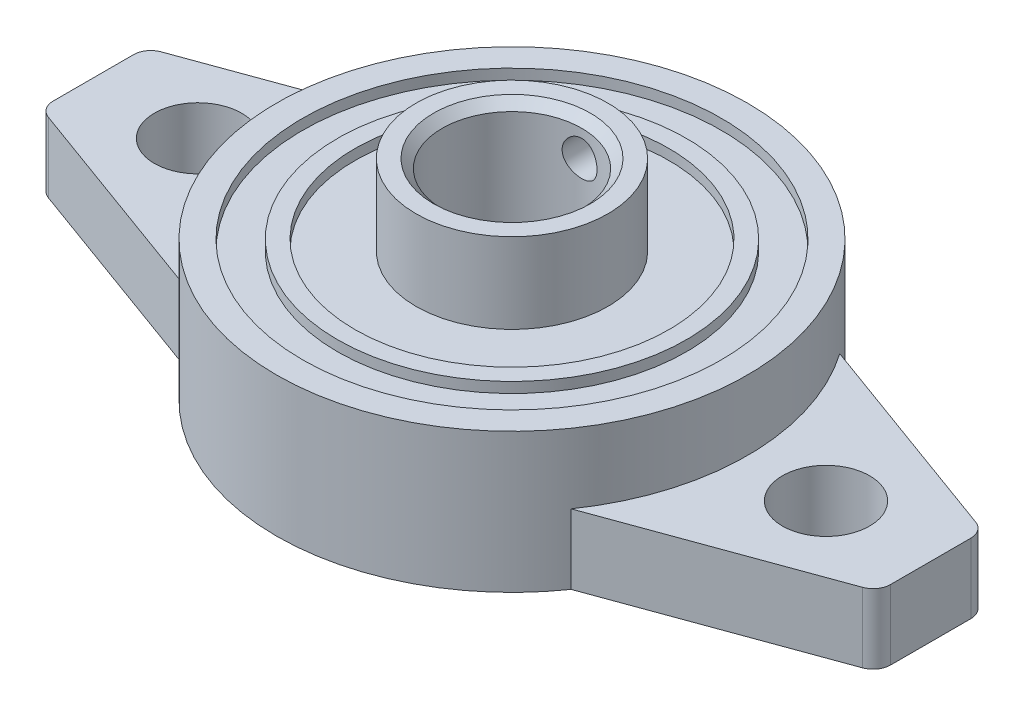
ISO-10303-21;
HEADER;
FILE_DESCRIPTION(('STEP AP214'),'2;1');
FILE_NAME('part.step','',(''),(''),'','','');
FILE_SCHEMA(('AUTOMOTIVE_DESIGN { 1 0 10303 214 1 1 1 1 }'));
ENDSEC;
DATA;
#1=APPLICATION_CONTEXT('core data for automotive mechanical design processes');
#2=APPLICATION_PROTOCOL_DEFINITION('international standard','automotive_design',2000,#1);
#3=PRODUCT_CONTEXT('',#1,'mechanical');
#4=PRODUCT('Part','Part','',(#3));
#5=PRODUCT_RELATED_PRODUCT_CATEGORY('part','',(#4));
#6=PRODUCT_DEFINITION_FORMATION('','',#4);
#7=PRODUCT_DEFINITION_CONTEXT('part definition',#1,'design');
#8=PRODUCT_DEFINITION('design','',#6,#7);
#9=PRODUCT_DEFINITION_SHAPE('','',#8);
#10=(LENGTH_UNIT() NAMED_UNIT(*) SI_UNIT(.MILLI.,.METRE.));
#11=(NAMED_UNIT(*) PLANE_ANGLE_UNIT() SI_UNIT($,.RADIAN.));
#12=(NAMED_UNIT(*) SI_UNIT($,.STERADIAN.) SOLID_ANGLE_UNIT());
#13=UNCERTAINTY_MEASURE_WITH_UNIT(LENGTH_MEASURE(1.E-05),#10,'distance_accuracy_value','');
#14=(GEOMETRIC_REPRESENTATION_CONTEXT(3) GLOBAL_UNCERTAINTY_ASSIGNED_CONTEXT((#13)) GLOBAL_UNIT_ASSIGNED_CONTEXT((#10,
#11,#12)) REPRESENTATION_CONTEXT('',''));
#15=CARTESIAN_POINT('',(0.,0.,0.));
#16=DIRECTION('',(0.,0.,1.));
#17=DIRECTION('',(1.,0.,0.));
#18=AXIS2_PLACEMENT_3D('',#15,#16,#17);
#19=CARTESIAN_POINT('',(0.,-2.50000000007189E-05,0.));
#20=DIRECTION('',(0.,1.,0.));
#21=DIRECTION('',(0.,0.,1.));
#22=AXIS2_PLACEMENT_3D('',#19,#20,#21);
#23=CYLINDRICAL_SURFACE('',#22,4.);
#24=CARTESIAN_POINT('',(0.,1.5,0.));
#25=DIRECTION('',(0.,-1.,0.));
#26=DIRECTION('',(0.,0.,-1.));
#27=AXIS2_PLACEMENT_3D('',#24,#25,#26);
#28=CIRCLE('',#27,4.);
#29=CARTESIAN_POINT('',(0.,1.5,-4.));
#30=VERTEX_POINT('',#29);
#31=EDGE_CURVE('E50',#30,#30,#28,.T.);
#32=ORIENTED_EDGE('',*,*,#31,.T.);
#33=EDGE_LOOP('',(#32));
#34=FACE_BOUND('',#33,.T.);
#35=CARTESIAN_POINT('',(0.,11.5,0.));
#36=DIRECTION('',(0.,1.,0.));
#37=DIRECTION('',(0.,0.,1.));
#38=AXIS2_PLACEMENT_3D('',#35,#36,#37);
#39=CIRCLE('',#38,4.);
#40=CARTESIAN_POINT('',(0.,11.5,4.));
#41=VERTEX_POINT('',#40);
#42=EDGE_CURVE('E308',#41,#41,#39,.T.);
#43=ORIENTED_EDGE('',*,*,#42,.T.);
#44=EDGE_LOOP('',(#43));
#45=FACE_BOUND('',#44,.T.);
#46=CARTESIAN_POINT('',(1.,10.,-3.87298334620742));
#47=CARTESIAN_POINT('',(0.9999984314387,9.94477969964321,-3.87298440057185));
#48=CARTESIAN_POINT('',(0.99541049820807,9.88954204056864,-3.87417722499278));
#49=CARTESIAN_POINT('',(0.977209250194446,9.78065296876739,-3.87880744892249));
#50=CARTESIAN_POINT('',(0.963590682698077,9.72700249822003,-3.8822461547418));
#51=CARTESIAN_POINT('',(0.927796479849635,9.62287858471216,-3.89095489813012));
#52=CARTESIAN_POINT('',(0.905631891140944,9.57240113784224,-3.8962225706936));
#53=CARTESIAN_POINT('',(0.853408456505407,9.47587565898752,-3.90799276818327));
#54=CARTESIAN_POINT('',(0.823349275424505,9.42982781516885,-3.91449534553241));
#55=CARTESIAN_POINT('',(0.755483370924517,9.34245534189415,-3.92816286540368));
#56=CARTESIAN_POINT('',(0.717534755081557,9.30124255985972,-3.93533839048709));
#57=CARTESIAN_POINT('',(0.635272825640328,9.22569544225612,-3.94945150206622));
#58=CARTESIAN_POINT('',(0.590958917672139,9.19136174975137,-3.95638906626691));
#59=CARTESIAN_POINT('',(0.496458080431564,9.13008981294742,-3.96936166208095));
#60=CARTESIAN_POINT('',(0.446197830478043,9.10326144473539,-3.975382749602));
#61=CARTESIAN_POINT('',(0.341705273717109,9.05847614233878,-3.9857232477043));
#62=CARTESIAN_POINT('',(0.287473554316777,9.0405178992338,-3.99004290933747));
#63=CARTESIAN_POINT('',(0.177743503501663,9.01434086616856,-3.99641903539262));
#64=CARTESIAN_POINT('',(0.122293087819589,9.00593214226937,-3.99851957537723));
#65=CARTESIAN_POINT('',(0.0107315277051075,8.99849664828978,-4.00037437642922));
#66=CARTESIAN_POINT('',(-0.0453795178152279,8.99946849111616,-4.00012898438682));
#67=CARTESIAN_POINT('',(-0.155352247172388,9.01062994010006,-3.99735237981413));
#68=CARTESIAN_POINT('',(-0.209236215601068,9.02061453002154,-3.99487200936349));
#69=CARTESIAN_POINT('',(-0.314538247413687,9.0491885080194,-3.98796334609942));
#70=CARTESIAN_POINT('',(-0.365956179370439,9.06777835415096,-3.98353494959376));
#71=CARTESIAN_POINT('',(-0.465406703501807,9.11320102827483,-3.97315003880358));
#72=CARTESIAN_POINT('',(-0.513404509766505,9.1401068178647,-3.96718007878021));
#73=CARTESIAN_POINT('',(-0.604275622340489,9.2013422716465,-3.9543596152386));
#74=CARTESIAN_POINT('',(-0.647148035085506,9.23567322742425,-3.94750895860996));
#75=CARTESIAN_POINT('',(-0.727774035084957,9.31188349679295,-3.93345485507808));
#76=CARTESIAN_POINT('',(-0.7653576790752,9.35394195693911,-3.92624687810367));
#77=CARTESIAN_POINT('',(-0.832976375963019,9.4438399894161,-3.91246017406683));
#78=CARTESIAN_POINT('',(-0.863011076046017,9.4916798317964,-3.90588147642388));
#79=CARTESIAN_POINT('',(-0.914788129022598,9.59211601365959,-3.89408198732659));
#80=CARTESIAN_POINT('',(-0.936489566970491,9.64473429212528,-3.88886793490288));
#81=CARTESIAN_POINT('',(-0.970685620636341,9.75303418723058,-3.88047456055983));
#82=CARTESIAN_POINT('',(-0.98318220655291,9.80871514559325,-3.87729480324087));
#83=CARTESIAN_POINT('',(-0.998331855466071,9.91998380060925,-3.87342142415656));
#84=CARTESIAN_POINT('',(-1.00123618956785,9.97553511733185,-3.87266435637459));
#85=CARTESIAN_POINT('',(-0.997806796206219,10.0863287746313,-3.87354937392416));
#86=CARTESIAN_POINT('',(-0.99147391913952,10.1415711431805,-3.87519123840506));
#87=CARTESIAN_POINT('',(-0.969970185575065,10.2492457059819,-3.88062832781824));
#88=CARTESIAN_POINT('',(-0.954945627312698,10.3017090906283,-3.8843878809375));
#89=CARTESIAN_POINT('',(-0.916647232668248,10.4033725831407,-3.89360287308385));
#90=CARTESIAN_POINT('',(-0.893372419085018,10.4525723036221,-3.89905851299445));
#91=CARTESIAN_POINT('',(-0.838708267174622,10.5473765111469,-3.91118454837305));
#92=CARTESIAN_POINT('',(-0.807168701534251,10.5928915360172,-3.91787667442657));
#93=CARTESIAN_POINT('',(-0.737060292934455,10.6780753451205,-3.93166833228686));
#94=CARTESIAN_POINT('',(-0.698490294805438,10.71774316666,-3.93876793091388));
#95=CARTESIAN_POINT('',(-0.614262720984724,10.7911244170284,-3.95278961212643));
#96=CARTESIAN_POINT('',(-0.568451952531591,10.8246640250195,-3.95970280824734));
#97=CARTESIAN_POINT('',(-0.471702682694674,10.8835743467805,-3.97238886645494));
#98=CARTESIAN_POINT('',(-0.42076444895759,10.9089454866433,-3.97816178801584));
#99=CARTESIAN_POINT('',(-0.315558201731089,10.9505784138112,-3.98788046295326));
#100=CARTESIAN_POINT('',(-0.26131738102788,10.9669057137516,-3.99183932008964));
#101=CARTESIAN_POINT('',(-0.150749760318806,10.9901841338434,-3.99754117358315));
#102=CARTESIAN_POINT('',(-0.0944233650412424,10.9971370634956,-3.99928459757363));
#103=CARTESIAN_POINT('',(0.0170835264433275,11.0013675895755,-4.00034169408811));
#104=CARTESIAN_POINT('',(0.0722538269660343,10.9989017090954,-3.99971978880008));
#105=CARTESIAN_POINT('',(0.181367496414741,10.9849521727057,-3.99625896457423));
#106=CARTESIAN_POINT('',(0.235310901780888,10.9734687849869,-3.99342011157094));
#107=CARTESIAN_POINT('',(0.340171035644817,10.9419477802291,-3.98585432853963));
#108=CARTESIAN_POINT('',(0.391102494581019,10.9219565466854,-3.98113764502668));
#109=CARTESIAN_POINT('',(0.488917053041468,10.8740294209807,-3.97031288913382));
#110=CARTESIAN_POINT('',(0.535799641265051,10.8460925273304,-3.96420464137727));
#111=CARTESIAN_POINT('',(0.625401928423901,10.7822847660029,-3.95107249681342));
#112=CARTESIAN_POINT('',(0.667994988300588,10.7462398570926,-3.94403016945647));
#113=CARTESIAN_POINT('',(0.746615020271252,10.6675771480262,-3.92990649053207));
#114=CARTESIAN_POINT('',(0.782640325068178,10.6249576839021,-3.92282512952424));
#115=CARTESIAN_POINT('',(0.84776202647924,10.5333985857987,-3.90927475860683));
#116=CARTESIAN_POINT('',(0.876716619446593,10.4843558765875,-3.90281963730391));
#117=CARTESIAN_POINT('',(0.925926896615622,10.3819445100772,-3.8914395555011));
#118=CARTESIAN_POINT('',(0.946188909759557,10.3285790338927,-3.88651348244814));
#119=CARTESIAN_POINT('',(0.974422528565572,10.2294229881737,-3.87951908741315));
#120=CARTESIAN_POINT('',(0.983993170595829,10.1841068356176,-3.87708663005761));
#121=CARTESIAN_POINT('',(0.99678229257282,10.0925311309985,-3.87381838580358));
#122=CARTESIAN_POINT('',(1.00000131437052,10.0462716597494,-3.87298246270639));
#123=CARTESIAN_POINT('',(1.,10.,-3.87298334620742));
#124=B_SPLINE_CURVE_WITH_KNOTS('',3,(#46,#47,#48,#49,#50,#51,#52,#53,#54,#55,#56,#57,#58,#59,
#60,#61,#62,#63,#64,#65,#66,#67,#68,#69,#70,#71,#72,#73,#74,#75,#76,#77,#78,#79,#80,#81,#82,#83,
#84,#85,#86,#87,#88,#89,#90,#91,#92,#93,#94,#95,#96,#97,#98,#99,#100,#101,#102,#103,#104,#105,
#106,#107,#108,#109,#110,#111,#112,#113,#114,#115,#116,#117,#118,#119,#120,#121,#122,#123),
.UNSPECIFIED.,.T.,.F.,(4,2,2,2,2,2,2,2,2,2,2,2,2,2,2,2,2,2,2,2,2,2,2,2,2,2,2,2,2,2,2,2,2,2,2,2,
2,2,4),(0.,0.16549097667523,0.331078296534212,0.496452290829153,0.661833306984659,
0.830495816734649,0.999174085882212,1.17020598555443,1.34121263935111,1.50875500394413,
1.67627259462683,1.84007305071853,2.00388222686189,2.16917149698052,2.3344895418384,
2.50428186625039,2.67408212476195,2.84470572799635,3.01529280048094,3.18137429900962,
3.34744050869795,3.51078961999957,3.67415808564842,3.84073138339938,4.00733207550293,
4.17810132382402,4.34886166284096,4.51836829119046,4.6878421955989,4.85273378447257,
5.01762046947067,5.18161950620159,5.34563922291504,5.51358838629103,5.68158012622478,
5.85270590910145,6.02370688542923,6.16239130867207,6.30106390036083),.UNSPECIFIED.);
#125=CARTESIAN_POINT('',(1.,10.,-3.87298334620742));
#126=VERTEX_POINT('',#125);
#127=EDGE_CURVE('E208',#126,#126,#124,.T.);
#128=ORIENTED_EDGE('',*,*,#127,.T.);
#129=EDGE_LOOP('',(#128));
#130=FACE_BOUND('',#129,.T.);
#131=ADVANCED_FACE('F41',(#34,#45,#130),#23,.F.);
#132=CARTESIAN_POINT('',(0.,8.,0.));
#133=DIRECTION('',(0.,1.,0.));
#134=DIRECTION('',(0.,0.,1.));
#135=AXIS2_PLACEMENT_3D('',#132,#133,#134);
#136=PLANE('',#135);
#137=CARTESIAN_POINT('',(0.,8.,0.));
#138=DIRECTION('',(0.,1.,0.));
#139=DIRECTION('',(0.,0.,1.));
#140=AXIS2_PLACEMENT_3D('',#137,#138,#139);
#141=CIRCLE('',#140,9.);
#142=CARTESIAN_POINT('',(0.,8.,9.));
#143=VERTEX_POINT('',#142);
#144=EDGE_CURVE('E397',#143,#143,#141,.T.);
#145=ORIENTED_EDGE('',*,*,#144,.F.);
#146=EDGE_LOOP('',(#145));
#147=FACE_BOUND('',#146,.T.);
#148=CARTESIAN_POINT('',(0.,8.,0.));
#149=DIRECTION('',(0.,1.,0.));
#150=DIRECTION('',(0.,0.,1.));
#151=AXIS2_PLACEMENT_3D('',#148,#149,#150);
#152=CIRCLE('',#151,10.);
#153=CARTESIAN_POINT('',(0.,8.,10.));
#154=VERTEX_POINT('',#153);
#155=EDGE_CURVE('E386',#154,#154,#152,.T.);
#156=ORIENTED_EDGE('',*,*,#155,.T.);
#157=EDGE_LOOP('',(#156));
#158=FACE_BOUND('',#157,.T.);
#159=ADVANCED_FACE('F237',(#147,#158),#136,.T.);
#160=CARTESIAN_POINT('',(0.,8.,0.));
#161=DIRECTION('',(0.,1.,0.));
#162=DIRECTION('',(0.,0.,1.));
#163=AXIS2_PLACEMENT_3D('',#160,#161,#162);
#164=CIRCLE('',#163,12.);
#165=CARTESIAN_POINT('',(0.,8.,12.));
#166=VERTEX_POINT('',#165);
#167=EDGE_CURVE('E269',#166,#166,#164,.T.);
#168=ORIENTED_EDGE('',*,*,#167,.F.);
#169=EDGE_LOOP('',(#168));
#170=FACE_BOUND('',#169,.T.);
#171=CARTESIAN_POINT('',(0.,8.,0.));
#172=DIRECTION('',(0.,1.,0.));
#173=DIRECTION('',(0.,0.,1.));
#174=AXIS2_PLACEMENT_3D('',#171,#172,#173);
#175=CIRCLE('',#174,13.5);
#176=CARTESIAN_POINT('',(0.,8.,13.5));
#177=VERTEX_POINT('',#176);
#178=EDGE_CURVE('E262',#177,#177,#175,.T.);
#179=ORIENTED_EDGE('',*,*,#178,.T.);
#180=EDGE_LOOP('',(#179));
#181=FACE_BOUND('',#180,.T.);
#182=ADVANCED_FACE('F372',(#170,#181),#136,.T.);
#183=CARTESIAN_POINT('',(23.,4.,2.29979246179029));
#184=DIRECTION('',(0.,1.,0.));
#185=DIRECTION('',(0.,0.,1.));
#186=AXIS2_PLACEMENT_3D('',#183,#184,#185);
#187=PLANE('',#186);
#188=CARTESIAN_POINT('',(0.,4.,0.));
#189=DIRECTION('',(0.,1.,0.));
#190=DIRECTION('',(0.,0.,1.));
#191=AXIS2_PLACEMENT_3D('',#188,#189,#190);
#192=CIRCLE('',#191,13.5);
#193=CARTESIAN_POINT('',(11.0893677538251,4.,7.69908584316501));
#194=VERTEX_POINT('',#193);
#195=CARTESIAN_POINT('',(11.0893677538251,4.,-7.69908584316501));
#196=VERTEX_POINT('',#195);
#197=EDGE_CURVE('E258',#194,#196,#192,.T.);
#198=ORIENTED_EDGE('',*,*,#197,.F.);
#199=DIRECTION('',(0.93969262078591,0.,-0.342020143325665));
#200=VECTOR('',#199,1.);
#201=CARTESIAN_POINT('',(23.3420201433257,4.,3.2394850825762));
#202=LINE('',#201,#200);
#203=CARTESIAN_POINT('',(23.3420201433257,4.,3.2394850825762));
#204=VERTEX_POINT('',#203);
#205=EDGE_CURVE('E58',#194,#204,#202,.T.);
#206=ORIENTED_EDGE('',*,*,#205,.T.);
#207=CARTESIAN_POINT('',(23.,4.,2.29979246179029));
#208=DIRECTION('',(0.,1.,0.));
#209=DIRECTION('',(0.,0.,1.));
#210=AXIS2_PLACEMENT_3D('',#207,#208,#209);
#211=CIRCLE('',#210,1.);
#212=CARTESIAN_POINT('',(24.,4.,2.29979246179028));
#213=VERTEX_POINT('',#212);
#214=EDGE_CURVE('E639',#204,#213,#211,.T.);
#215=ORIENTED_EDGE('',*,*,#214,.T.);
#216=DIRECTION('',(0.,0.,-1.));
#217=VECTOR('',#216,1.);
#218=CARTESIAN_POINT('',(24.,4.,2.29979246179028));
#219=LINE('',#218,#217);
#220=CARTESIAN_POINT('',(24.,4.,-2.29979246179028));
#221=VERTEX_POINT('',#220);
#222=EDGE_CURVE('E116',#213,#221,#219,.T.);
#223=ORIENTED_EDGE('',*,*,#222,.T.);
#224=CARTESIAN_POINT('',(23.,4.,-2.29979246179029));
#225=DIRECTION('',(0.,1.,0.));
#226=DIRECTION('',(0.,0.,1.));
#227=AXIS2_PLACEMENT_3D('',#224,#225,#226);
#228=CIRCLE('',#227,1.);
#229=CARTESIAN_POINT('',(23.3420201433257,4.,-3.2394850825762));
#230=VERTEX_POINT('',#229);
#231=EDGE_CURVE('E193',#221,#230,#228,.T.);
#232=ORIENTED_EDGE('',*,*,#231,.T.);
#233=DIRECTION('',(-0.93969262078591,0.,-0.342020143325665));
#234=VECTOR('',#233,1.);
#235=CARTESIAN_POINT('',(23.3420201433257,4.,-3.2394850825762));
#236=LINE('',#235,#234);
#237=EDGE_CURVE('E189',#230,#196,#236,.T.);
#238=ORIENTED_EDGE('',*,*,#237,.T.);
#239=EDGE_LOOP('',(#198,#206,#215,#223,#232,#238));
#240=FACE_BOUND('',#239,.T.);
#241=CARTESIAN_POINT('',(18.,4.,0.));
#242=DIRECTION('',(0.,1.,0.));
#243=DIRECTION('',(0.,0.,1.));
#244=AXIS2_PLACEMENT_3D('',#241,#242,#243);
#245=CIRCLE('',#244,2.5);
#246=CARTESIAN_POINT('',(18.,4.,2.5));
#247=VERTEX_POINT('',#246);
#248=EDGE_CURVE('E274',#247,#247,#245,.T.);
#249=ORIENTED_EDGE('',*,*,#248,.F.);
#250=EDGE_LOOP('',(#249));
#251=FACE_BOUND('',#250,.T.);
#252=ADVANCED_FACE('F366',(#240,#251),#187,.T.);
#253=CARTESIAN_POINT('',(-11.0893677538251,4.,-7.69908584316501));
#254=VERTEX_POINT('',#253);
#255=CARTESIAN_POINT('',(-11.0893677538251,4.,7.69908584316501));
#256=VERTEX_POINT('',#255);
#257=EDGE_CURVE('E170',#254,#256,#192,.T.);
#258=ORIENTED_EDGE('',*,*,#257,.F.);
#259=DIRECTION('',(-0.93969262078591,0.,0.342020143325665));
#260=VECTOR('',#259,1.);
#261=CARTESIAN_POINT('',(-23.3420201433257,4.,-3.2394850825762));
#262=LINE('',#261,#260);
#263=CARTESIAN_POINT('',(-23.3420201433257,4.,-3.2394850825762));
#264=VERTEX_POINT('',#263);
#265=EDGE_CURVE('E186',#254,#264,#262,.T.);
#266=ORIENTED_EDGE('',*,*,#265,.T.);
#267=CARTESIAN_POINT('',(-23.,4.,-2.29979246179029));
#268=DIRECTION('',(0.,1.,0.));
#269=DIRECTION('',(0.,0.,1.));
#270=AXIS2_PLACEMENT_3D('',#267,#268,#269);
#271=CIRCLE('',#270,1.);
#272=CARTESIAN_POINT('',(-24.,4.,-2.29979246179028));
#273=VERTEX_POINT('',#272);
#274=EDGE_CURVE('E188',#264,#273,#271,.T.);
#275=ORIENTED_EDGE('',*,*,#274,.T.);
#276=DIRECTION('',(0.,0.,1.));
#277=VECTOR('',#276,1.);
#278=CARTESIAN_POINT('',(-24.,4.,2.29979246179028));
#279=LINE('',#278,#277);
#280=CARTESIAN_POINT('',(-24.,4.,2.29979246179028));
#281=VERTEX_POINT('',#280);
#282=EDGE_CURVE('E148',#273,#281,#279,.T.);
#283=ORIENTED_EDGE('',*,*,#282,.T.);
#284=CARTESIAN_POINT('',(-23.,4.,2.29979246179029));
#285=DIRECTION('',(0.,1.,0.));
#286=DIRECTION('',(0.,0.,1.));
#287=AXIS2_PLACEMENT_3D('',#284,#285,#286);
#288=CIRCLE('',#287,1.);
#289=CARTESIAN_POINT('',(-23.3420201433257,4.,3.2394850825762));
#290=VERTEX_POINT('',#289);
#291=EDGE_CURVE('E140',#281,#290,#288,.T.);
#292=ORIENTED_EDGE('',*,*,#291,.T.);
#293=DIRECTION('',(0.93969262078591,0.,0.342020143325665));
#294=VECTOR('',#293,1.);
#295=CARTESIAN_POINT('',(-23.3420201433257,4.,3.2394850825762));
#296=LINE('',#295,#294);
#297=EDGE_CURVE('E145',#290,#256,#296,.T.);
#298=ORIENTED_EDGE('',*,*,#297,.T.);
#299=EDGE_LOOP('',(#258,#266,#275,#283,#292,#298));
#300=FACE_BOUND('',#299,.T.);
#301=CARTESIAN_POINT('',(-18.,4.,0.));
#302=DIRECTION('',(0.,1.,0.));
#303=DIRECTION('',(0.,0.,1.));
#304=AXIS2_PLACEMENT_3D('',#301,#302,#303);
#305=CIRCLE('',#304,2.5);
#306=CARTESIAN_POINT('',(-18.,4.,2.5));
#307=VERTEX_POINT('',#306);
#308=EDGE_CURVE('E635',#307,#307,#305,.T.);
#309=ORIENTED_EDGE('',*,*,#308,.F.);
#310=EDGE_LOOP('',(#309));
#311=FACE_BOUND('',#310,.T.);
#312=ADVANCED_FACE('F142',(#300,#311),#187,.T.);
#313=CARTESIAN_POINT('',(23.,0.,2.29979246179029));
#314=DIRECTION('',(0.,1.,0.));
#315=DIRECTION('',(0.,0.,1.));
#316=AXIS2_PLACEMENT_3D('',#313,#314,#315);
#317=PLANE('',#316);
#318=CARTESIAN_POINT('',(0.,0.,0.));
#319=DIRECTION('',(0.,-1.,0.));
#320=DIRECTION('',(0.,0.,-1.));
#321=AXIS2_PLACEMENT_3D('',#318,#319,#320);
#322=CIRCLE('',#321,12.5);
#323=CARTESIAN_POINT('',(0.,0.,-12.5));
#324=VERTEX_POINT('',#323);
#325=EDGE_CURVE('E231',#324,#324,#322,.T.);
#326=ORIENTED_EDGE('',*,*,#325,.F.);
#327=EDGE_LOOP('',(#326));
#328=FACE_BOUND('',#327,.T.);
#329=CARTESIAN_POINT('',(-18.,0.,0.));
#330=DIRECTION('',(0.,1.,0.));
#331=DIRECTION('',(0.,0.,1.));
#332=AXIS2_PLACEMENT_3D('',#329,#330,#331);
#333=CIRCLE('',#332,2.5);
#334=CARTESIAN_POINT('',(-18.,0.,2.5));
#335=VERTEX_POINT('',#334);
#336=EDGE_CURVE('E627',#335,#335,#333,.T.);
#337=ORIENTED_EDGE('',*,*,#336,.T.);
#338=EDGE_LOOP('',(#337));
#339=FACE_BOUND('',#338,.T.);
#340=CARTESIAN_POINT('',(23.,0.,2.29979246179029));
#341=DIRECTION('',(0.,1.,0.));
#342=DIRECTION('',(0.,0.,1.));
#343=AXIS2_PLACEMENT_3D('',#340,#341,#342);
#344=CIRCLE('',#343,1.);
#345=CARTESIAN_POINT('',(23.3420201433257,0.,3.2394850825762));
#346=VERTEX_POINT('',#345);
#347=CARTESIAN_POINT('',(24.,0.,2.29979246179028));
#348=VERTEX_POINT('',#347);
#349=EDGE_CURVE('E629',#346,#348,#344,.T.);
#350=ORIENTED_EDGE('',*,*,#349,.F.);
#351=DIRECTION('',(0.93969262078591,0.,-0.342020143325665));
#352=VECTOR('',#351,1.);
#353=CARTESIAN_POINT('',(23.3420201433257,0.,3.2394850825762));
#354=LINE('',#353,#352);
#355=CARTESIAN_POINT('',(11.0893677538251,0.,7.69908584316501));
#356=VERTEX_POINT('',#355);
#357=EDGE_CURVE('E107',#356,#346,#354,.T.);
#358=ORIENTED_EDGE('',*,*,#357,.F.);
#359=CARTESIAN_POINT('',(0.,0.,0.));
#360=DIRECTION('',(0.,1.,0.));
#361=DIRECTION('',(0.,0.,1.));
#362=AXIS2_PLACEMENT_3D('',#359,#360,#361);
#363=CIRCLE('',#362,13.5);
#364=CARTESIAN_POINT('',(-11.0893677538251,0.,7.69908584316501));
#365=VERTEX_POINT('',#364);
#366=EDGE_CURVE('E101',#365,#356,#363,.T.);
#367=ORIENTED_EDGE('',*,*,#366,.F.);
#368=DIRECTION('',(0.93969262078591,0.,0.342020143325665));
#369=VECTOR('',#368,1.);
#370=CARTESIAN_POINT('',(-23.3420201433257,0.,3.2394850825762));
#371=LINE('',#370,#369);
#372=CARTESIAN_POINT('',(-23.3420201433257,0.,3.2394850825762));
#373=VERTEX_POINT('',#372);
#374=EDGE_CURVE('E661',#373,#365,#371,.T.);
#375=ORIENTED_EDGE('',*,*,#374,.F.);
#376=CARTESIAN_POINT('',(-23.,0.,2.29979246179029));
#377=DIRECTION('',(0.,1.,0.));
#378=DIRECTION('',(0.,0.,1.));
#379=AXIS2_PLACEMENT_3D('',#376,#377,#378);
#380=CIRCLE('',#379,1.);
#381=CARTESIAN_POINT('',(-24.,0.,2.29979246179028));
#382=VERTEX_POINT('',#381);
#383=EDGE_CURVE('E157',#382,#373,#380,.T.);
#384=ORIENTED_EDGE('',*,*,#383,.F.);
#385=DIRECTION('',(0.,0.,1.));
#386=VECTOR('',#385,1.);
#387=CARTESIAN_POINT('',(-24.,0.,2.29979246179028));
#388=LINE('',#387,#386);
#389=CARTESIAN_POINT('',(-24.,0.,-2.29979246179028));
#390=VERTEX_POINT('',#389);
#391=EDGE_CURVE('E658',#390,#382,#388,.T.);
#392=ORIENTED_EDGE('',*,*,#391,.F.);
#393=CARTESIAN_POINT('',(-23.,0.,-2.29979246179029));
#394=DIRECTION('',(0.,1.,0.));
#395=DIRECTION('',(0.,0.,1.));
#396=AXIS2_PLACEMENT_3D('',#393,#394,#395);
#397=CIRCLE('',#396,1.);
#398=CARTESIAN_POINT('',(-23.3420201433257,0.,-3.2394850825762));
#399=VERTEX_POINT('',#398);
#400=EDGE_CURVE('E656',#399,#390,#397,.T.);
#401=ORIENTED_EDGE('',*,*,#400,.F.);
#402=DIRECTION('',(-0.93969262078591,0.,0.342020143325665));
#403=VECTOR('',#402,1.);
#404=CARTESIAN_POINT('',(-23.3420201433257,0.,-3.2394850825762));
#405=LINE('',#404,#403);
#406=CARTESIAN_POINT('',(-11.0893677538251,0.,-7.69908584316501));
#407=VERTEX_POINT('',#406);
#408=EDGE_CURVE('E654',#407,#399,#405,.T.);
#409=ORIENTED_EDGE('',*,*,#408,.F.);
#410=CARTESIAN_POINT('',(0.,0.,0.));
#411=DIRECTION('',(0.,1.,0.));
#412=DIRECTION('',(0.,0.,1.));
#413=AXIS2_PLACEMENT_3D('',#410,#411,#412);
#414=CIRCLE('',#413,13.5);
#415=CARTESIAN_POINT('',(11.0893677538251,0.,-7.69908584316501));
#416=VERTEX_POINT('',#415);
#417=EDGE_CURVE('E652',#416,#407,#414,.T.);
#418=ORIENTED_EDGE('',*,*,#417,.F.);
#419=DIRECTION('',(-0.93969262078591,0.,-0.342020143325665));
#420=VECTOR('',#419,1.);
#421=CARTESIAN_POINT('',(23.3420201433257,0.,-3.2394850825762));
#422=LINE('',#421,#420);
#423=CARTESIAN_POINT('',(23.3420201433257,0.,-3.2394850825762));
#424=VERTEX_POINT('',#423);
#425=EDGE_CURVE('E650',#424,#416,#422,.T.);
#426=ORIENTED_EDGE('',*,*,#425,.F.);
#427=CARTESIAN_POINT('',(23.,0.,-2.29979246179029));
#428=DIRECTION('',(0.,1.,0.));
#429=DIRECTION('',(0.,0.,1.));
#430=AXIS2_PLACEMENT_3D('',#427,#428,#429);
#431=CIRCLE('',#430,1.);
#432=CARTESIAN_POINT('',(24.,0.,-2.29979246179028));
#433=VERTEX_POINT('',#432);
#434=EDGE_CURVE('E648',#433,#424,#431,.T.);
#435=ORIENTED_EDGE('',*,*,#434,.F.);
#436=DIRECTION('',(0.,0.,-1.));
#437=VECTOR('',#436,1.);
#438=CARTESIAN_POINT('',(24.,0.,2.29979246179028));
#439=LINE('',#438,#437);
#440=EDGE_CURVE('E646',#348,#433,#439,.T.);
#441=ORIENTED_EDGE('',*,*,#440,.F.);
#442=EDGE_LOOP('',(#350,#358,#367,#375,#384,#392,#401,#409,#418,#426,#435,#441));
#443=FACE_BOUND('',#442,.T.);
#444=CARTESIAN_POINT('',(18.,0.,0.));
#445=DIRECTION('',(0.,1.,0.));
#446=DIRECTION('',(0.,0.,1.));
#447=AXIS2_PLACEMENT_3D('',#444,#445,#446);
#448=CIRCLE('',#447,2.5);
#449=CARTESIAN_POINT('',(18.,0.,2.5));
#450=VERTEX_POINT('',#449);
#451=EDGE_CURVE('E272',#450,#450,#448,.T.);
#452=ORIENTED_EDGE('',*,*,#451,.T.);
#453=EDGE_LOOP('',(#452));
#454=FACE_BOUND('',#453,.T.);
#455=ADVANCED_FACE('F328',(#328,#339,#443,#454),#317,.F.);
#456=CARTESIAN_POINT('',(23.,4.,2.29979246179029));
#457=DIRECTION('',(0.,-1.,0.));
#458=DIRECTION('',(0.,0.,-1.));
#459=AXIS2_PLACEMENT_3D('',#456,#457,#458);
#460=CYLINDRICAL_SURFACE('',#459,1.);
#461=ORIENTED_EDGE('',*,*,#349,.T.);
#462=DIRECTION('',(0.,-1.,0.));
#463=VECTOR('',#462,1.);
#464=CARTESIAN_POINT('',(24.,4.,2.29979246179028));
#465=LINE('',#464,#463);
#466=EDGE_CURVE('E278',#213,#348,#465,.T.);
#467=ORIENTED_EDGE('',*,*,#466,.F.);
#468=ORIENTED_EDGE('',*,*,#214,.F.);
#469=DIRECTION('',(0.,-1.,0.));
#470=VECTOR('',#469,1.);
#471=CARTESIAN_POINT('',(23.3420201433257,4.,3.2394850825762));
#472=LINE('',#471,#470);
#473=EDGE_CURVE('E166',#204,#346,#472,.T.);
#474=ORIENTED_EDGE('',*,*,#473,.T.);
#475=EDGE_LOOP('',(#461,#467,#468,#474));
#476=FACE_BOUND('',#475,.T.);
#477=ADVANCED_FACE('F324',(#476),#460,.T.);
#478=CARTESIAN_POINT('',(24.,4.,2.29979246179028));
#479=DIRECTION('',(-1.,0.,0.));
#480=DIRECTION('',(0.,0.,1.));
#481=AXIS2_PLACEMENT_3D('',#478,#479,#480);
#482=PLANE('',#481);
#483=ORIENTED_EDGE('',*,*,#440,.T.);
#484=DIRECTION('',(0.,-1.,0.));
#485=VECTOR('',#484,1.);
#486=CARTESIAN_POINT('',(24.,4.,-2.29979246179028));
#487=LINE('',#486,#485);
#488=EDGE_CURVE('E300',#221,#433,#487,.T.);
#489=ORIENTED_EDGE('',*,*,#488,.F.);
#490=ORIENTED_EDGE('',*,*,#222,.F.);
#491=ORIENTED_EDGE('',*,*,#466,.T.);
#492=EDGE_LOOP('',(#483,#489,#490,#491));
#493=FACE_BOUND('',#492,.T.);
#494=ADVANCED_FACE('F327',(#493),#482,.F.);
#495=CARTESIAN_POINT('',(23.,4.,-2.29979246179029));
#496=DIRECTION('',(0.,-1.,0.));
#497=DIRECTION('',(0.,0.,-1.));
#498=AXIS2_PLACEMENT_3D('',#495,#496,#497);
#499=CYLINDRICAL_SURFACE('',#498,1.);
#500=ORIENTED_EDGE('',*,*,#434,.T.);
#501=DIRECTION('',(0.,-1.,0.));
#502=VECTOR('',#501,1.);
#503=CARTESIAN_POINT('',(23.3420201433257,4.,-3.2394850825762));
#504=LINE('',#503,#502);
#505=EDGE_CURVE('E198',#230,#424,#504,.T.);
#506=ORIENTED_EDGE('',*,*,#505,.F.);
#507=ORIENTED_EDGE('',*,*,#231,.F.);
#508=ORIENTED_EDGE('',*,*,#488,.T.);
#509=EDGE_LOOP('',(#500,#506,#507,#508));
#510=FACE_BOUND('',#509,.T.);
#511=ADVANCED_FACE('F331',(#510),#499,.T.);
#512=CARTESIAN_POINT('',(23.3420201433257,4.,-3.2394850825762));
#513=DIRECTION('',(-0.342020143325665,0.,0.93969262078591));
#514=DIRECTION('',(0.93969262078591,0.,0.342020143325665));
#515=AXIS2_PLACEMENT_3D('',#512,#513,#514);
#516=PLANE('',#515);
#517=ORIENTED_EDGE('',*,*,#425,.T.);
#518=DIRECTION('',(0.,-1.,0.));
#519=VECTOR('',#518,1.);
#520=CARTESIAN_POINT('',(11.0893677538251,4.,-7.69908584316501));
#521=LINE('',#520,#519);
#522=EDGE_CURVE('E182',#196,#416,#521,.T.);
#523=ORIENTED_EDGE('',*,*,#522,.F.);
#524=ORIENTED_EDGE('',*,*,#237,.F.);
#525=ORIENTED_EDGE('',*,*,#505,.T.);
#526=EDGE_LOOP('',(#517,#523,#524,#525));
#527=FACE_BOUND('',#526,.T.);
#528=ADVANCED_FACE('F334',(#527),#516,.F.);
#529=CARTESIAN_POINT('',(-23.3420201433257,4.,-3.2394850825762));
#530=DIRECTION('',(0.342020143325665,0.,0.93969262078591));
#531=DIRECTION('',(0.93969262078591,0.,-0.342020143325665));
#532=AXIS2_PLACEMENT_3D('',#529,#530,#531);
#533=PLANE('',#532);
#534=ORIENTED_EDGE('',*,*,#408,.T.);
#535=DIRECTION('',(0.,-1.,0.));
#536=VECTOR('',#535,1.);
#537=CARTESIAN_POINT('',(-23.3420201433257,4.,-3.2394850825762));
#538=LINE('',#537,#536);
#539=EDGE_CURVE('E183',#264,#399,#538,.T.);
#540=ORIENTED_EDGE('',*,*,#539,.F.);
#541=ORIENTED_EDGE('',*,*,#265,.F.);
#542=DIRECTION('',(0.,-1.,0.));
#543=VECTOR('',#542,1.);
#544=CARTESIAN_POINT('',(-11.0893677538251,4.,-7.69908584316501));
#545=LINE('',#544,#543);
#546=EDGE_CURVE('E179',#254,#407,#545,.T.);
#547=ORIENTED_EDGE('',*,*,#546,.T.);
#548=EDGE_LOOP('',(#534,#540,#541,#547));
#549=FACE_BOUND('',#548,.T.);
#550=ADVANCED_FACE('F337',(#549),#533,.F.);
#551=CARTESIAN_POINT('',(-23.,4.,-2.29979246179029));
#552=DIRECTION('',(0.,-1.,0.));
#553=DIRECTION('',(0.,0.,-1.));
#554=AXIS2_PLACEMENT_3D('',#551,#552,#553);
#555=CYLINDRICAL_SURFACE('',#554,1.);
#556=ORIENTED_EDGE('',*,*,#400,.T.);
#557=DIRECTION('',(0.,-1.,0.));
#558=VECTOR('',#557,1.);
#559=CARTESIAN_POINT('',(-24.,4.,-2.29979246179028));
#560=LINE('',#559,#558);
#561=EDGE_CURVE('E294',#273,#390,#560,.T.);
#562=ORIENTED_EDGE('',*,*,#561,.F.);
#563=ORIENTED_EDGE('',*,*,#274,.F.);
#564=ORIENTED_EDGE('',*,*,#539,.T.);
#565=EDGE_LOOP('',(#556,#562,#563,#564));
#566=FACE_BOUND('',#565,.T.);
#567=ADVANCED_FACE('F341',(#566),#555,.T.);
#568=CARTESIAN_POINT('',(-24.,4.,2.29979246179028));
#569=DIRECTION('',(1.,0.,0.));
#570=DIRECTION('',(0.,0.,-1.));
#571=AXIS2_PLACEMENT_3D('',#568,#569,#570);
#572=PLANE('',#571);
#573=ORIENTED_EDGE('',*,*,#391,.T.);
#574=DIRECTION('',(0.,-1.,0.));
#575=VECTOR('',#574,1.);
#576=CARTESIAN_POINT('',(-24.,4.,2.29979246179028));
#577=LINE('',#576,#575);
#578=EDGE_CURVE('E160',#281,#382,#577,.T.);
#579=ORIENTED_EDGE('',*,*,#578,.F.);
#580=ORIENTED_EDGE('',*,*,#282,.F.);
#581=ORIENTED_EDGE('',*,*,#561,.T.);
#582=EDGE_LOOP('',(#573,#579,#580,#581));
#583=FACE_BOUND('',#582,.T.);
#584=ADVANCED_FACE('F345',(#583),#572,.F.);
#585=CARTESIAN_POINT('',(-23.,4.,2.29979246179029));
#586=DIRECTION('',(0.,-1.,0.));
#587=DIRECTION('',(0.,0.,-1.));
#588=AXIS2_PLACEMENT_3D('',#585,#586,#587);
#589=CYLINDRICAL_SURFACE('',#588,1.);
#590=ORIENTED_EDGE('',*,*,#383,.T.);
#591=DIRECTION('',(0.,-1.,0.));
#592=VECTOR('',#591,1.);
#593=CARTESIAN_POINT('',(-23.3420201433257,4.,3.2394850825762));
#594=LINE('',#593,#592);
#595=EDGE_CURVE('E154',#290,#373,#594,.T.);
#596=ORIENTED_EDGE('',*,*,#595,.F.);
#597=ORIENTED_EDGE('',*,*,#291,.F.);
#598=ORIENTED_EDGE('',*,*,#578,.T.);
#599=EDGE_LOOP('',(#590,#596,#597,#598));
#600=FACE_BOUND('',#599,.T.);
#601=ADVANCED_FACE('F155',(#600),#589,.T.);
#602=CARTESIAN_POINT('',(-23.3420201433257,4.,3.2394850825762));
#603=DIRECTION('',(0.342020143325665,0.,-0.93969262078591));
#604=DIRECTION('',(-0.93969262078591,0.,-0.342020143325665));
#605=AXIS2_PLACEMENT_3D('',#602,#603,#604);
#606=PLANE('',#605);
#607=ORIENTED_EDGE('',*,*,#374,.T.);
#608=DIRECTION('',(0.,-1.,0.));
#609=VECTOR('',#608,1.);
#610=CARTESIAN_POINT('',(-11.0893677538251,4.,7.69908584316501));
#611=LINE('',#610,#609);
#612=EDGE_CURVE('E161',#256,#365,#611,.T.);
#613=ORIENTED_EDGE('',*,*,#612,.F.);
#614=ORIENTED_EDGE('',*,*,#297,.F.);
#615=ORIENTED_EDGE('',*,*,#595,.T.);
#616=EDGE_LOOP('',(#607,#613,#614,#615));
#617=FACE_BOUND('',#616,.T.);
#618=ADVANCED_FACE('F163',(#617),#606,.F.);
#619=CARTESIAN_POINT('',(0.,4.,0.));
#620=DIRECTION('',(0.,-1.,0.));
#621=DIRECTION('',(0.,0.,-1.));
#622=AXIS2_PLACEMENT_3D('',#619,#620,#621);
#623=CYLINDRICAL_SURFACE('',#622,13.5);
#624=ORIENTED_EDGE('',*,*,#366,.T.);
#625=DIRECTION('',(0.,-1.,0.));
#626=VECTOR('',#625,1.);
#627=CARTESIAN_POINT('',(11.0893677538251,4.,7.69908584316501));
#628=LINE('',#627,#626);
#629=EDGE_CURVE('E176',#194,#356,#628,.T.);
#630=ORIENTED_EDGE('',*,*,#629,.F.);
#631=ORIENTED_EDGE('',*,*,#197,.T.);
#632=ORIENTED_EDGE('',*,*,#522,.T.);
#633=ORIENTED_EDGE('',*,*,#417,.T.);
#634=ORIENTED_EDGE('',*,*,#546,.F.);
#635=ORIENTED_EDGE('',*,*,#257,.T.);
#636=ORIENTED_EDGE('',*,*,#612,.T.);
#637=EDGE_LOOP('',(#624,#630,#631,#632,#633,#634,#635,#636));
#638=FACE_BOUND('',#637,.T.);
#639=ORIENTED_EDGE('',*,*,#178,.F.);
#640=EDGE_LOOP('',(#639));
#641=FACE_BOUND('',#640,.T.);
#642=ADVANCED_FACE('F354',(#638,#641),#623,.T.);
#643=CARTESIAN_POINT('',(23.3420201433257,4.,3.2394850825762));
#644=DIRECTION('',(-0.342020143325665,0.,-0.93969262078591));
#645=DIRECTION('',(-0.93969262078591,0.,0.342020143325665));
#646=AXIS2_PLACEMENT_3D('',#643,#644,#645);
#647=PLANE('',#646);
#648=ORIENTED_EDGE('',*,*,#357,.T.);
#649=ORIENTED_EDGE('',*,*,#473,.F.);
#650=ORIENTED_EDGE('',*,*,#205,.F.);
#651=ORIENTED_EDGE('',*,*,#629,.T.);
#652=EDGE_LOOP('',(#648,#649,#650,#651));
#653=FACE_BOUND('',#652,.T.);
#654=ADVANCED_FACE('F357',(#653),#647,.F.);
#655=CARTESIAN_POINT('',(-18.,4.,0.));
#656=DIRECTION('',(0.,-1.,0.));
#657=DIRECTION('',(0.,0.,-1.));
#658=AXIS2_PLACEMENT_3D('',#655,#656,#657);
#659=CYLINDRICAL_SURFACE('',#658,2.5);
#660=ORIENTED_EDGE('',*,*,#308,.T.);
#661=EDGE_LOOP('',(#660));
#662=FACE_BOUND('',#661,.T.);
#663=ORIENTED_EDGE('',*,*,#336,.F.);
#664=EDGE_LOOP('',(#663));
#665=FACE_BOUND('',#664,.T.);
#666=ADVANCED_FACE('F360',(#662,#665),#659,.F.);
#667=CARTESIAN_POINT('',(18.,4.,0.));
#668=DIRECTION('',(0.,-1.,0.));
#669=DIRECTION('',(0.,0.,-1.));
#670=AXIS2_PLACEMENT_3D('',#667,#668,#669);
#671=CYLINDRICAL_SURFACE('',#670,2.5);
#672=ORIENTED_EDGE('',*,*,#248,.T.);
#673=EDGE_LOOP('',(#672));
#674=FACE_BOUND('',#673,.T.);
#675=ORIENTED_EDGE('',*,*,#451,.F.);
#676=EDGE_LOOP('',(#675));
#677=FACE_BOUND('',#676,.T.);
#678=ADVANCED_FACE('F250',(#674,#677),#671,.F.);
#679=CARTESIAN_POINT('',(0.,12.,0.));
#680=DIRECTION('',(0.,-1.,0.));
#681=DIRECTION('',(0.,0.,-1.));
#682=AXIS2_PLACEMENT_3D('',#679,#680,#681);
#683=CYLINDRICAL_SURFACE('',#682,5.5);
#684=CARTESIAN_POINT('',(0.,11.,-5.5));
#685=CARTESIAN_POINT('',(-0.0556786358221865,10.9999978406697,-5.49999900363929));
#686=CARTESIAN_POINT('',(-0.111385724959101,10.9953341212587,-5.49914576366717));
#687=CARTESIAN_POINT('',(-0.221232203424155,10.9768132669875,-5.49582423750998));
#688=CARTESIAN_POINT('',(-0.275370193633037,10.9629481757093,-5.4933545536127));
#689=CARTESIAN_POINT('',(-0.380473786256874,10.9264614351645,-5.48707661617533));
#690=CARTESIAN_POINT('',(-0.431442131965089,10.9038474839051,-5.4832695396596));
#691=CARTESIAN_POINT('',(-0.528856001692252,10.8505263344041,-5.47473335749149));
#692=CARTESIAN_POINT('',(-0.575301933839523,10.8198198674059,-5.47000433515661));
#693=CARTESIAN_POINT('',(-0.662882220256193,10.7508170451786,-5.46008716749916));
#694=CARTESIAN_POINT('',(-0.703958113016729,10.7124470790096,-5.45489486298539));
#695=CARTESIAN_POINT('',(-0.779126786705396,10.6293648229551,-5.44466747605904));
#696=CARTESIAN_POINT('',(-0.813219083974887,10.5846520941554,-5.43963240455629));
#697=CARTESIAN_POINT('',(-0.873693475082385,10.4897436352701,-5.43024920104883));
#698=CARTESIAN_POINT('',(-0.90001656632778,10.4395097323848,-5.42590643555049));
#699=CARTESIAN_POINT('',(-0.943827734749893,10.335240674838,-5.41845791638451));
#700=CARTESIAN_POINT('',(-0.961316526416375,10.2812058279875,-5.41535206268372));
#701=CARTESIAN_POINT('',(-0.986775988556575,10.1714926753217,-5.41077076758353));
#702=CARTESIAN_POINT('',(-0.994848332127224,10.1158387041452,-5.40927792311172));
#703=CARTESIAN_POINT('',(-1.00156124368344,10.0039477963427,-5.40803915716155));
#704=CARTESIAN_POINT('',(-1.00020260648321,9.94771090924199,-5.40829308847026));
#705=CARTESIAN_POINT('',(-0.988174672135,9.83698404293349,-5.4105033252459));
#706=CARTESIAN_POINT('',(-0.977620588495361,9.78248106605214,-5.41243856407131));
#707=CARTESIAN_POINT('',(-0.947682616700133,9.67603249081642,-5.41776030636955));
#708=CARTESIAN_POINT('',(-0.928298373715941,9.62408699532411,-5.42114686816159));
#709=CARTESIAN_POINT('',(-0.881136488946478,9.52388860461063,-5.42901190776358));
#710=CARTESIAN_POINT('',(-0.853311951857699,9.47565827866694,-5.43349645857176));
#711=CARTESIAN_POINT('',(-0.790092516870214,9.38450763152735,-5.44304811005858));
#712=CARTESIAN_POINT('',(-0.754696895117922,9.34158781867688,-5.44811526641734));
#713=CARTESIAN_POINT('',(-0.67671699709176,9.26161050177781,-5.45835320404272));
#714=CARTESIAN_POINT('',(-0.634034086328447,9.22464915578154,-5.46352440908234));
#715=CARTESIAN_POINT('',(-0.543022270346655,9.15839743325958,-5.47331875218544));
#716=CARTESIAN_POINT('',(-0.494693314749078,9.12910712518937,-5.4779418853578));
#717=CARTESIAN_POINT('',(-0.393663799248647,9.07901630510749,-5.4861276891267));
#718=CARTESIAN_POINT('',(-0.340958390197744,9.05822536565201,-5.48968916279611));
#719=CARTESIAN_POINT('',(-0.232724207231331,9.02581840375315,-5.49534102735441));
#720=CARTESIAN_POINT('',(-0.177195715658031,9.01420146571304,-5.49743156504548));
#721=CARTESIAN_POINT('',(-0.0657193247892486,9.00060511904044,-5.49988596689329));
#722=CARTESIAN_POINT('',(-0.00978800605446601,8.99849388827296,-5.50027344670572));
#723=CARTESIAN_POINT('',(0.101628619485485,9.00361589909075,-5.4993431512375));
#724=CARTESIAN_POINT('',(0.157113946726542,9.01084871003587,-5.49802545454355));
#725=CARTESIAN_POINT('',(0.26564854879638,9.03434387478094,-5.49384754316226));
#726=CARTESIAN_POINT('',(0.318712648729159,9.05053993459141,-5.49099865786081));
#727=CARTESIAN_POINT('',(0.421372356878306,9.09143041426097,-5.48407647561111));
#728=CARTESIAN_POINT('',(0.470967740480476,9.11612538384885,-5.48000309946218));
#729=CARTESIAN_POINT('',(0.565847623537468,9.17360731890146,-5.4710248979242));
#730=CARTESIAN_POINT('',(0.611082226042441,9.20647534357796,-5.466111908073));
#731=CARTESIAN_POINT('',(0.695441069111737,9.27926018833555,-5.45602144035543));
#732=CARTESIAN_POINT('',(0.734564774871662,9.31917762470597,-5.45084393939252));
#733=CARTESIAN_POINT('',(0.806088689438399,9.40552344072425,-5.44073019778822));
#734=CARTESIAN_POINT('',(0.838399183707093,9.45202665326293,-5.43579776060943));
#735=CARTESIAN_POINT('',(0.894749932760069,9.54987809070325,-5.4268075504051));
#736=CARTESIAN_POINT('',(0.918790483153976,9.60122614234219,-5.42274974611769));
#737=CARTESIAN_POINT('',(0.957789726208733,9.70707537484587,-5.41599772307738));
#738=CARTESIAN_POINT('',(0.9727905393092,9.76156061536903,-5.41329719008374));
#739=CARTESIAN_POINT('',(0.993415200892769,9.87233149431554,-5.40955063272695));
#740=CARTESIAN_POINT('',(0.999040037268146,9.92861694242446,-5.40850443405679));
#741=CARTESIAN_POINT('',(1.00072156831592,10.0404926877318,-5.40819346941308));
#742=CARTESIAN_POINT('',(0.996919685006163,10.0960808357193,-5.40890237272057));
#743=CARTESIAN_POINT('',(0.980164234564073,10.2058118190087,-5.41196354373513));
#744=CARTESIAN_POINT('',(0.967210714528589,10.2599546617471,-5.41431580298504));
#745=CARTESIAN_POINT('',(0.932577835792383,10.3651880986977,-5.42038786040457));
#746=CARTESIAN_POINT('',(0.910912905096162,10.4162835801117,-5.42410539649874));
#747=CARTESIAN_POINT('',(0.859487368324115,10.5141372235824,-5.43249088757423));
#748=CARTESIAN_POINT('',(0.829726237845035,10.5608951044228,-5.4371589041147));
#749=CARTESIAN_POINT('',(0.762457718313995,10.6494564372978,-5.44700162325733));
#750=CARTESIAN_POINT('',(0.724847077765498,10.6911807849354,-5.45218253915553));
#751=CARTESIAN_POINT('',(0.64316325711682,10.7677735405061,-5.46241996034325));
#752=CARTESIAN_POINT('',(0.599088593400467,10.8026403701961,-5.46747643675957));
#753=CARTESIAN_POINT('',(0.50528559482315,10.8648001485617,-5.47694487148596));
#754=CARTESIAN_POINT('',(0.455512924895248,10.8920270925901,-5.48135106586716));
#755=CARTESIAN_POINT('',(0.352036952543172,10.937689608037,-5.48896630496674));
#756=CARTESIAN_POINT('',(0.298337462743335,10.9561335796392,-5.49217649292367));
#757=CARTESIAN_POINT('',(0.203720874729203,10.9798877151511,-5.49637035188244));
#758=CARTESIAN_POINT('',(0.163362713638244,10.9874171664802,-5.49772390136792));
#759=CARTESIAN_POINT('',(0.0820081710661011,10.9974740468975,-5.49953908216522));
#760=CARTESIAN_POINT('',(0.0410118042204163,11.0000015905209,-5.50000073389999));
#761=CARTESIAN_POINT('',(0.,11.,-5.5));
#762=B_SPLINE_CURVE_WITH_KNOTS('',3,(#684,#685,#686,#687,#688,#689,#690,#691,#692,#693,#694,
#695,#696,#697,#698,#699,#700,#701,#702,#703,#704,#705,#706,#707,#708,#709,#710,#711,#712,#713,
#714,#715,#716,#717,#718,#719,#720,#721,#722,#723,#724,#725,#726,#727,#728,#729,#730,#731,#732,
#733,#734,#735,#736,#737,#738,#739,#740,#741,#742,#743,#744,#745,#746,#747,#748,#749,#750,#751,
#752,#753,#754,#755,#756,#757,#758,#759,#760,#761),.UNSPECIFIED.,.T.,.F.,(4,2,2,2,2,2,2,2,2,2,2,
2,2,2,2,2,2,2,2,2,2,2,2,2,2,2,2,2,2,2,2,2,2,2,2,2,2,2,4),(0.,0.166885945776166,
0.333916386036295,0.500800191433372,0.667668922300752,0.836225072984427,1.00479289331539,
1.17460976101825,1.34441289227865,1.51236510586323,1.68030316512101,1.84616683645448,
2.01203717339435,2.17884653230812,2.34567184660628,2.51496605220936,2.68426176852323,
2.85374763511906,3.02321658430727,3.19032800498682,3.35743172425399,3.52331571642715,
3.68921044037111,3.85682113397833,4.02444648808062,4.1941575306523,4.36386250626238,
4.53277050538079,4.70166070651801,4.86803254865186,5.03440353459656,5.20050010129481,
5.36660742888452,5.53505557265019,5.70354243914732,5.87344302271464,6.04318078249083,
6.1661085511478,6.28903350493382),.UNSPECIFIED.);
#763=CARTESIAN_POINT('',(0.,11.,-5.5));
#764=VERTEX_POINT('',#763);
#765=EDGE_CURVE('E201',#764,#764,#762,.T.);
#766=ORIENTED_EDGE('',*,*,#765,.T.);
#767=EDGE_LOOP('',(#766));
#768=FACE_BOUND('',#767,.T.);
#769=CARTESIAN_POINT('',(0.,12.,0.));
#770=DIRECTION('',(0.,1.,0.));
#771=DIRECTION('',(0.,0.,1.));
#772=AXIS2_PLACEMENT_3D('',#769,#770,#771);
#773=CIRCLE('',#772,5.5);
#774=CARTESIAN_POINT('',(0.,12.,5.5));
#775=VERTEX_POINT('',#774);
#776=EDGE_CURVE('E256',#775,#775,#773,.T.);
#777=ORIENTED_EDGE('',*,*,#776,.F.);
#778=EDGE_LOOP('',(#777));
#779=FACE_BOUND('',#778,.T.);
#780=CARTESIAN_POINT('',(0.,7.4,0.));
#781=DIRECTION('',(0.,1.,0.));
#782=DIRECTION('',(0.,0.,1.));
#783=AXIS2_PLACEMENT_3D('',#780,#781,#782);
#784=CIRCLE('',#783,5.5);
#785=CARTESIAN_POINT('',(0.,7.4,5.5));
#786=VERTEX_POINT('',#785);
#787=EDGE_CURVE('E394',#786,#786,#784,.F.);
#788=ORIENTED_EDGE('',*,*,#787,.F.);
#789=EDGE_LOOP('',(#788));
#790=FACE_BOUND('',#789,.T.);
#791=ADVANCED_FACE('F211',(#768,#779,#790),#683,.T.);
#792=CARTESIAN_POINT('',(0.,12.,0.));
#793=DIRECTION('',(0.,1.,0.));
#794=DIRECTION('',(0.,0.,1.));
#795=AXIS2_PLACEMENT_3D('',#792,#793,#794);
#796=PLANE('',#795);
#797=CARTESIAN_POINT('',(0.,12.,0.));
#798=DIRECTION('',(0.,1.,0.));
#799=DIRECTION('',(0.,0.,1.));
#800=AXIS2_PLACEMENT_3D('',#797,#798,#799);
#801=CIRCLE('',#800,4.50000000000001);
#802=CARTESIAN_POINT('',(0.,12.,4.50000000000001));
#803=VERTEX_POINT('',#802);
#804=EDGE_CURVE('E12',#803,#803,#801,.F.);
#805=ORIENTED_EDGE('',*,*,#804,.T.);
#806=EDGE_LOOP('',(#805));
#807=FACE_BOUND('',#806,.T.);
#808=ORIENTED_EDGE('',*,*,#776,.T.);
#809=EDGE_LOOP('',(#808));
#810=FACE_BOUND('',#809,.T.);
#811=ADVANCED_FACE('F241',(#807,#810),#796,.T.);
#812=CARTESIAN_POINT('',(0.,7.4,0.));
#813=DIRECTION('',(0.,1.,0.));
#814=DIRECTION('',(0.,0.,1.));
#815=AXIS2_PLACEMENT_3D('',#812,#813,#814);
#816=CYLINDRICAL_SURFACE('',#815,10.);
#817=CARTESIAN_POINT('',(0.,7.4,0.));
#818=DIRECTION('',(0.,1.,0.));
#819=DIRECTION('',(0.,0.,1.));
#820=AXIS2_PLACEMENT_3D('',#817,#818,#819);
#821=CIRCLE('',#820,10.);
#822=CARTESIAN_POINT('',(0.,7.4,10.));
#823=VERTEX_POINT('',#822);
#824=EDGE_CURVE('E265',#823,#823,#821,.T.);
#825=ORIENTED_EDGE('',*,*,#824,.T.);
#826=EDGE_LOOP('',(#825));
#827=FACE_BOUND('',#826,.T.);
#828=ORIENTED_EDGE('',*,*,#155,.F.);
#829=EDGE_LOOP('',(#828));
#830=FACE_BOUND('',#829,.T.);
#831=ADVANCED_FACE('F239',(#827,#830),#816,.T.);
#832=CARTESIAN_POINT('',(0.,7.4,0.));
#833=DIRECTION('',(0.,1.,0.));
#834=DIRECTION('',(0.,0.,1.));
#835=AXIS2_PLACEMENT_3D('',#832,#833,#834);
#836=CYLINDRICAL_SURFACE('',#835,12.);
#837=CARTESIAN_POINT('',(0.,7.4,0.));
#838=DIRECTION('',(0.,1.,0.));
#839=DIRECTION('',(0.,0.,1.));
#840=AXIS2_PLACEMENT_3D('',#837,#838,#839);
#841=CIRCLE('',#840,12.);
#842=CARTESIAN_POINT('',(0.,7.4,12.));
#843=VERTEX_POINT('',#842);
#844=EDGE_CURVE('E259',#843,#843,#841,.T.);
#845=ORIENTED_EDGE('',*,*,#844,.F.);
#846=EDGE_LOOP('',(#845));
#847=FACE_BOUND('',#846,.T.);
#848=ORIENTED_EDGE('',*,*,#167,.T.);
#849=EDGE_LOOP('',(#848));
#850=FACE_BOUND('',#849,.T.);
#851=ADVANCED_FACE('F248',(#847,#850),#836,.F.);
#852=CARTESIAN_POINT('',(0.,7.4,0.));
#853=DIRECTION('',(0.,1.,0.));
#854=DIRECTION('',(0.,0.,1.));
#855=AXIS2_PLACEMENT_3D('',#852,#853,#854);
#856=PLANE('',#855);
#857=ORIENTED_EDGE('',*,*,#824,.F.);
#858=EDGE_LOOP('',(#857));
#859=FACE_BOUND('',#858,.T.);
#860=ORIENTED_EDGE('',*,*,#844,.T.);
#861=EDGE_LOOP('',(#860));
#862=FACE_BOUND('',#861,.T.);
#863=ADVANCED_FACE('F420',(#859,#862),#856,.T.);
#864=CARTESIAN_POINT('',(0.,7.4,0.));
#865=DIRECTION('',(0.,1.,0.));
#866=DIRECTION('',(0.,0.,1.));
#867=AXIS2_PLACEMENT_3D('',#864,#865,#866);
#868=CYLINDRICAL_SURFACE('',#867,9.);
#869=CARTESIAN_POINT('',(0.,7.4,0.));
#870=DIRECTION('',(0.,1.,0.));
#871=DIRECTION('',(0.,0.,1.));
#872=AXIS2_PLACEMENT_3D('',#869,#870,#871);
#873=CIRCLE('',#872,9.);
#874=CARTESIAN_POINT('',(0.,7.4,9.));
#875=VERTEX_POINT('',#874);
#876=EDGE_CURVE('E390',#875,#875,#873,.T.);
#877=ORIENTED_EDGE('',*,*,#876,.F.);
#878=EDGE_LOOP('',(#877));
#879=FACE_BOUND('',#878,.T.);
#880=ORIENTED_EDGE('',*,*,#144,.T.);
#881=EDGE_LOOP('',(#880));
#882=FACE_BOUND('',#881,.T.);
#883=ADVANCED_FACE('F416',(#879,#882),#868,.F.);
#884=CARTESIAN_POINT('',(0.,7.4,0.));
#885=DIRECTION('',(0.,1.,0.));
#886=DIRECTION('',(0.,0.,1.));
#887=AXIS2_PLACEMENT_3D('',#884,#885,#886);
#888=PLANE('',#887);
#889=ORIENTED_EDGE('',*,*,#787,.T.);
#890=EDGE_LOOP('',(#889));
#891=FACE_BOUND('',#890,.T.);
#892=ORIENTED_EDGE('',*,*,#876,.T.);
#893=EDGE_LOOP('',(#892));
#894=FACE_BOUND('',#893,.T.);
#895=ADVANCED_FACE('F412',(#891,#894),#888,.T.);
#896=CARTESIAN_POINT('',(0.,1.,0.));
#897=DIRECTION('',(0.,-1.,0.));
#898=DIRECTION('',(0.,0.,-1.));
#899=AXIS2_PLACEMENT_3D('',#896,#897,#898);
#900=PLANE('',#899);
#901=CARTESIAN_POINT('',(0.,1.,0.));
#902=DIRECTION('',(0.,-1.,0.));
#903=DIRECTION('',(0.,0.,-1.));
#904=AXIS2_PLACEMENT_3D('',#901,#902,#903);
#905=CIRCLE('',#904,4.5);
#906=CARTESIAN_POINT('',(0.,1.,-4.5));
#907=VERTEX_POINT('',#906);
#908=EDGE_CURVE('E209',#907,#907,#905,.F.);
#909=ORIENTED_EDGE('',*,*,#908,.T.);
#910=EDGE_LOOP('',(#909));
#911=FACE_BOUND('',#910,.T.);
#912=CARTESIAN_POINT('',(0.,1.,0.));
#913=DIRECTION('',(0.,-1.,0.));
#914=DIRECTION('',(0.,0.,-1.));
#915=AXIS2_PLACEMENT_3D('',#912,#913,#914);
#916=CIRCLE('',#915,12.5);
#917=CARTESIAN_POINT('',(0.,1.,-12.5));
#918=VERTEX_POINT('',#917);
#919=EDGE_CURVE('E232',#918,#918,#916,.T.);
#920=ORIENTED_EDGE('',*,*,#919,.T.);
#921=EDGE_LOOP('',(#920));
#922=FACE_BOUND('',#921,.T.);
#923=ADVANCED_FACE('F222',(#911,#922),#900,.T.);
#924=CARTESIAN_POINT('',(0.,1.,0.));
#925=DIRECTION('',(0.,-1.,0.));
#926=DIRECTION('',(0.,0.,-1.));
#927=AXIS2_PLACEMENT_3D('',#924,#925,#926);
#928=CYLINDRICAL_SURFACE('',#927,12.5);
#929=ORIENTED_EDGE('',*,*,#919,.F.);
#930=EDGE_LOOP('',(#929));
#931=FACE_BOUND('',#930,.T.);
#932=ORIENTED_EDGE('',*,*,#325,.T.);
#933=EDGE_LOOP('',(#932));
#934=FACE_BOUND('',#933,.T.);
#935=ADVANCED_FACE('F220',(#931,#934),#928,.F.);
#936=CARTESIAN_POINT('',(0.,10.,-13.5));
#937=DIRECTION('',(0.,0.,1.));
#938=DIRECTION('',(1.,0.,0.));
#939=AXIS2_PLACEMENT_3D('',#936,#937,#938);
#940=CYLINDRICAL_SURFACE('',#939,1.);
#941=ORIENTED_EDGE('',*,*,#765,.F.);
#942=EDGE_LOOP('',(#941));
#943=FACE_BOUND('',#942,.T.);
#944=ORIENTED_EDGE('',*,*,#127,.F.);
#945=EDGE_LOOP('',(#944));
#946=FACE_BOUND('',#945,.T.);
#947=ADVANCED_FACE('F215',(#943,#946),#940,.F.);
#948=CARTESIAN_POINT('',(0.,1.,0.));
#949=DIRECTION('',(0.,-1.,0.));
#950=DIRECTION('',(0.,0.,-1.));
#951=AXIS2_PLACEMENT_3D('',#948,#949,#950);
#952=CONICAL_SURFACE('',#951,4.5,0.785398163397448);
#953=ORIENTED_EDGE('',*,*,#31,.F.);
#954=EDGE_LOOP('',(#953));
#955=FACE_BOUND('',#954,.T.);
#956=ORIENTED_EDGE('',*,*,#908,.F.);
#957=EDGE_LOOP('',(#956));
#958=FACE_BOUND('',#957,.T.);
#959=ADVANCED_FACE('F219',(#955,#958),#952,.F.);
#960=CARTESIAN_POINT('',(0.,11.5,0.));
#961=DIRECTION('',(0.,1.,0.));
#962=DIRECTION('',(0.,0.,1.));
#963=AXIS2_PLACEMENT_3D('',#960,#961,#962);
#964=CONICAL_SURFACE('',#963,4.,0.785398163397448);
#965=ORIENTED_EDGE('',*,*,#804,.F.);
#966=EDGE_LOOP('',(#965));
#967=FACE_BOUND('',#966,.T.);
#968=ORIENTED_EDGE('',*,*,#42,.F.);
#969=EDGE_LOOP('',(#968));
#970=FACE_BOUND('',#969,.T.);
#971=ADVANCED_FACE('F43',(#967,#970),#964,.F.);
#972=CLOSED_SHELL('',(#131,#159,#182,#252,#312,#455,#477,#494,#511,#528,#550,#567,#584,#601,
#618,#642,#654,#666,#678,#791,#811,#831,#851,#863,#883,#895,#923,#935,#947,#959,#971));
#973=MANIFOLD_SOLID_BREP('B2',#972);
#974=ADVANCED_BREP_SHAPE_REPRESENTATION('',(#18,#973),#14);
#975=SHAPE_DEFINITION_REPRESENTATION(#9,#974);
ENDSEC;
END-ISO-10303-21;
